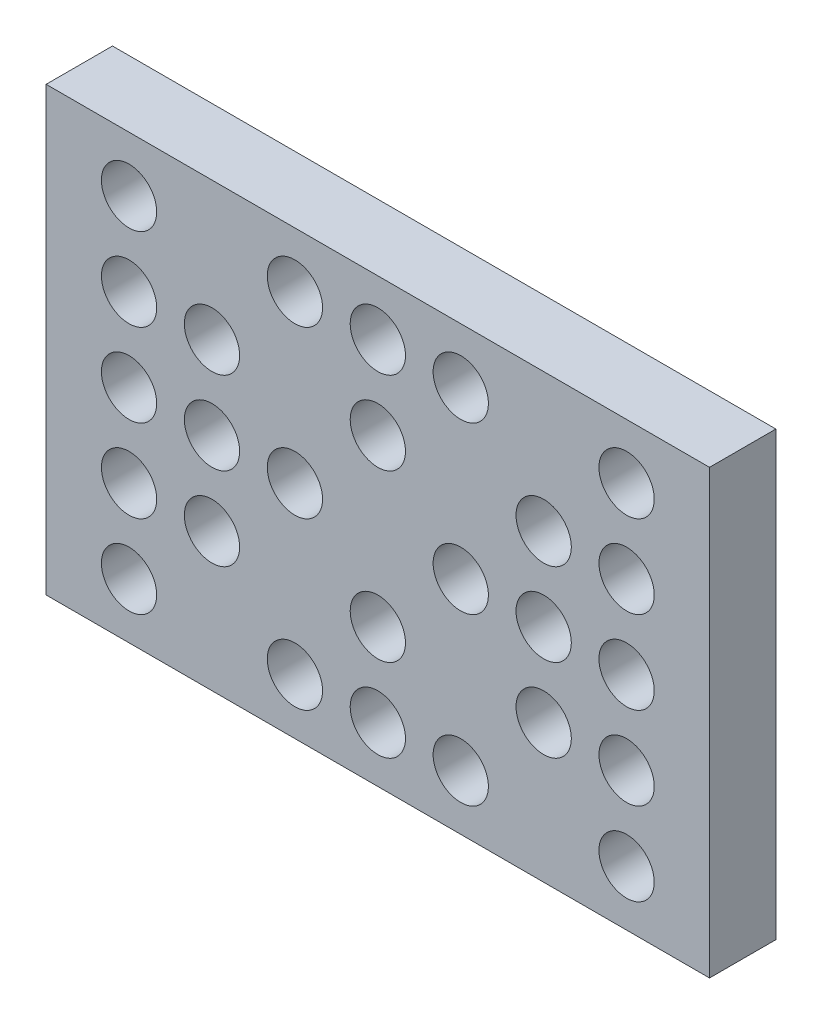
ISO-10303-21;
HEADER;
FILE_DESCRIPTION(('STEP AP214'),'2;1');
FILE_NAME('part.step','',(''),(''),'','','');
FILE_SCHEMA(('AUTOMOTIVE_DESIGN { 1 0 10303 214 1 1 1 1 }'));
ENDSEC;
DATA;
#1=APPLICATION_CONTEXT('core data for automotive mechanical design processes');
#2=APPLICATION_PROTOCOL_DEFINITION('international standard','automotive_design',2000,#1);
#3=PRODUCT_CONTEXT('',#1,'mechanical');
#4=PRODUCT('Part','Part','',(#3));
#5=PRODUCT_RELATED_PRODUCT_CATEGORY('part','',(#4));
#6=PRODUCT_DEFINITION_FORMATION('','',#4);
#7=PRODUCT_DEFINITION_CONTEXT('part definition',#1,'design');
#8=PRODUCT_DEFINITION('design','',#6,#7);
#9=PRODUCT_DEFINITION_SHAPE('','',#8);
#10=(LENGTH_UNIT() NAMED_UNIT(*) SI_UNIT(.MILLI.,.METRE.));
#11=(NAMED_UNIT(*) PLANE_ANGLE_UNIT() SI_UNIT($,.RADIAN.));
#12=(NAMED_UNIT(*) SI_UNIT($,.STERADIAN.) SOLID_ANGLE_UNIT());
#13=UNCERTAINTY_MEASURE_WITH_UNIT(LENGTH_MEASURE(1.E-05),#10,'distance_accuracy_value','');
#14=(GEOMETRIC_REPRESENTATION_CONTEXT(3) GLOBAL_UNCERTAINTY_ASSIGNED_CONTEXT((#13)) GLOBAL_UNIT_ASSIGNED_CONTEXT((#10,
#11,#12)) REPRESENTATION_CONTEXT('',''));
#15=CARTESIAN_POINT('',(0.,0.,0.));
#16=DIRECTION('',(0.,0.,1.));
#17=DIRECTION('',(1.,0.,0.));
#18=AXIS2_PLACEMENT_3D('',#15,#16,#17);
#19=CARTESIAN_POINT('',(-45.,30.,12.001));
#20=DIRECTION('',(0.,0.,-1.));
#21=DIRECTION('',(-1.,0.,0.));
#22=AXIS2_PLACEMENT_3D('',#19,#20,#21);
#23=CYLINDRICAL_SURFACE('',#22,5.);
#24=CARTESIAN_POINT('',(-45.,30.,12.));
#25=DIRECTION('',(0.,0.,1.));
#26=DIRECTION('',(1.,0.,0.));
#27=AXIS2_PLACEMENT_3D('',#24,#25,#26);
#28=CIRCLE('',#27,5.);
#29=CARTESIAN_POINT('',(-40.,30.,12.));
#30=VERTEX_POINT('',#29);
#31=EDGE_CURVE('E43',#30,#30,#28,.F.);
#32=ORIENTED_EDGE('',*,*,#31,.F.);
#33=EDGE_LOOP('',(#32));
#34=FACE_BOUND('',#33,.T.);
#35=CARTESIAN_POINT('',(-45.,30.,0.));
#36=DIRECTION('',(0.,0.,-1.));
#37=DIRECTION('',(-1.,0.,0.));
#38=AXIS2_PLACEMENT_3D('',#35,#36,#37);
#39=CIRCLE('',#38,5.);
#40=CARTESIAN_POINT('',(-50.,30.,0.));
#41=VERTEX_POINT('',#40);
#42=EDGE_CURVE('E11',#41,#41,#39,.T.);
#43=ORIENTED_EDGE('',*,*,#42,.T.);
#44=EDGE_LOOP('',(#43));
#45=FACE_BOUND('',#44,.T.);
#46=ADVANCED_FACE('F35',(#34,#45),#23,.F.);
#47=CARTESIAN_POINT('',(-15.,30.,12.001));
#48=DIRECTION('',(0.,0.,-1.));
#49=DIRECTION('',(-1.,0.,0.));
#50=AXIS2_PLACEMENT_3D('',#47,#48,#49);
#51=CYLINDRICAL_SURFACE('',#50,5.);
#52=CARTESIAN_POINT('',(-15.,30.,12.));
#53=DIRECTION('',(0.,0.,1.));
#54=DIRECTION('',(1.,0.,0.));
#55=AXIS2_PLACEMENT_3D('',#52,#53,#54);
#56=CIRCLE('',#55,5.);
#57=CARTESIAN_POINT('',(-9.99999999999999,30.,12.));
#58=VERTEX_POINT('',#57);
#59=EDGE_CURVE('E245',#58,#58,#56,.F.);
#60=ORIENTED_EDGE('',*,*,#59,.F.);
#61=EDGE_LOOP('',(#60));
#62=FACE_BOUND('',#61,.T.);
#63=CARTESIAN_POINT('',(-15.,30.,0.));
#64=DIRECTION('',(0.,0.,-1.));
#65=DIRECTION('',(-1.,0.,0.));
#66=AXIS2_PLACEMENT_3D('',#63,#64,#65);
#67=CIRCLE('',#66,5.);
#68=CARTESIAN_POINT('',(-20.,30.,0.));
#69=VERTEX_POINT('',#68);
#70=EDGE_CURVE('E248',#69,#69,#67,.T.);
#71=ORIENTED_EDGE('',*,*,#70,.T.);
#72=EDGE_LOOP('',(#71));
#73=FACE_BOUND('',#72,.T.);
#74=ADVANCED_FACE('F256',(#62,#73),#51,.F.);
#75=CARTESIAN_POINT('',(0.,30.,12.001));
#76=DIRECTION('',(0.,0.,-1.));
#77=DIRECTION('',(-1.,0.,0.));
#78=AXIS2_PLACEMENT_3D('',#75,#76,#77);
#79=CYLINDRICAL_SURFACE('',#78,5.);
#80=CARTESIAN_POINT('',(0.,30.,12.));
#81=DIRECTION('',(0.,0.,1.));
#82=DIRECTION('',(1.,0.,0.));
#83=AXIS2_PLACEMENT_3D('',#80,#81,#82);
#84=CIRCLE('',#83,5.);
#85=CARTESIAN_POINT('',(5.,30.,12.));
#86=VERTEX_POINT('',#85);
#87=EDGE_CURVE('E239',#86,#86,#84,.F.);
#88=ORIENTED_EDGE('',*,*,#87,.F.);
#89=EDGE_LOOP('',(#88));
#90=FACE_BOUND('',#89,.T.);
#91=CARTESIAN_POINT('',(0.,30.,0.));
#92=DIRECTION('',(0.,0.,-1.));
#93=DIRECTION('',(-1.,0.,0.));
#94=AXIS2_PLACEMENT_3D('',#91,#92,#93);
#95=CIRCLE('',#94,5.);
#96=CARTESIAN_POINT('',(-4.99999999999999,30.,0.));
#97=VERTEX_POINT('',#96);
#98=EDGE_CURVE('E242',#97,#97,#95,.T.);
#99=ORIENTED_EDGE('',*,*,#98,.T.);
#100=EDGE_LOOP('',(#99));
#101=FACE_BOUND('',#100,.T.);
#102=ADVANCED_FACE('F370',(#90,#101),#79,.F.);
#103=CARTESIAN_POINT('',(15.,30.,12.001));
#104=DIRECTION('',(0.,0.,-1.));
#105=DIRECTION('',(-1.,0.,0.));
#106=AXIS2_PLACEMENT_3D('',#103,#104,#105);
#107=CYLINDRICAL_SURFACE('',#106,5.);
#108=CARTESIAN_POINT('',(15.,30.,12.));
#109=DIRECTION('',(0.,0.,1.));
#110=DIRECTION('',(1.,0.,0.));
#111=AXIS2_PLACEMENT_3D('',#108,#109,#110);
#112=CIRCLE('',#111,5.);
#113=CARTESIAN_POINT('',(20.,30.,12.));
#114=VERTEX_POINT('',#113);
#115=EDGE_CURVE('E233',#114,#114,#112,.F.);
#116=ORIENTED_EDGE('',*,*,#115,.F.);
#117=EDGE_LOOP('',(#116));
#118=FACE_BOUND('',#117,.T.);
#119=CARTESIAN_POINT('',(15.,30.,0.));
#120=DIRECTION('',(0.,0.,-1.));
#121=DIRECTION('',(-1.,0.,0.));
#122=AXIS2_PLACEMENT_3D('',#119,#120,#121);
#123=CIRCLE('',#122,5.);
#124=CARTESIAN_POINT('',(10.,30.,0.));
#125=VERTEX_POINT('',#124);
#126=EDGE_CURVE('E236',#125,#125,#123,.T.);
#127=ORIENTED_EDGE('',*,*,#126,.T.);
#128=EDGE_LOOP('',(#127));
#129=FACE_BOUND('',#128,.T.);
#130=ADVANCED_FACE('F366',(#118,#129),#107,.F.);
#131=CARTESIAN_POINT('',(45.,30.,12.001));
#132=DIRECTION('',(0.,0.,-1.));
#133=DIRECTION('',(-1.,0.,0.));
#134=AXIS2_PLACEMENT_3D('',#131,#132,#133);
#135=CYLINDRICAL_SURFACE('',#134,5.);
#136=CARTESIAN_POINT('',(45.,30.,12.));
#137=DIRECTION('',(0.,0.,1.));
#138=DIRECTION('',(1.,0.,0.));
#139=AXIS2_PLACEMENT_3D('',#136,#137,#138);
#140=CIRCLE('',#139,5.);
#141=CARTESIAN_POINT('',(50.,30.,12.));
#142=VERTEX_POINT('',#141);
#143=EDGE_CURVE('E227',#142,#142,#140,.F.);
#144=ORIENTED_EDGE('',*,*,#143,.F.);
#145=EDGE_LOOP('',(#144));
#146=FACE_BOUND('',#145,.T.);
#147=CARTESIAN_POINT('',(45.,30.,0.));
#148=DIRECTION('',(0.,0.,-1.));
#149=DIRECTION('',(-1.,0.,0.));
#150=AXIS2_PLACEMENT_3D('',#147,#148,#149);
#151=CIRCLE('',#150,5.);
#152=CARTESIAN_POINT('',(40.,30.,0.));
#153=VERTEX_POINT('',#152);
#154=EDGE_CURVE('E230',#153,#153,#151,.T.);
#155=ORIENTED_EDGE('',*,*,#154,.T.);
#156=EDGE_LOOP('',(#155));
#157=FACE_BOUND('',#156,.T.);
#158=ADVANCED_FACE('F362',(#146,#157),#135,.F.);
#159=CARTESIAN_POINT('',(-45.,15.,12.001));
#160=DIRECTION('',(0.,0.,-1.));
#161=DIRECTION('',(-1.,0.,0.));
#162=AXIS2_PLACEMENT_3D('',#159,#160,#161);
#163=CYLINDRICAL_SURFACE('',#162,5.);
#164=CARTESIAN_POINT('',(-45.,15.,12.));
#165=DIRECTION('',(0.,0.,1.));
#166=DIRECTION('',(1.,0.,0.));
#167=AXIS2_PLACEMENT_3D('',#164,#165,#166);
#168=CIRCLE('',#167,5.);
#169=CARTESIAN_POINT('',(-40.,15.,12.));
#170=VERTEX_POINT('',#169);
#171=EDGE_CURVE('E221',#170,#170,#168,.F.);
#172=ORIENTED_EDGE('',*,*,#171,.F.);
#173=EDGE_LOOP('',(#172));
#174=FACE_BOUND('',#173,.T.);
#175=CARTESIAN_POINT('',(-45.,15.,0.));
#176=DIRECTION('',(0.,0.,-1.));
#177=DIRECTION('',(-1.,0.,0.));
#178=AXIS2_PLACEMENT_3D('',#175,#176,#177);
#179=CIRCLE('',#178,5.);
#180=CARTESIAN_POINT('',(-50.,15.,0.));
#181=VERTEX_POINT('',#180);
#182=EDGE_CURVE('E224',#181,#181,#179,.T.);
#183=ORIENTED_EDGE('',*,*,#182,.T.);
#184=EDGE_LOOP('',(#183));
#185=FACE_BOUND('',#184,.T.);
#186=ADVANCED_FACE('F358',(#174,#185),#163,.F.);
#187=CARTESIAN_POINT('',(-30.,15.,12.001));
#188=DIRECTION('',(0.,0.,-1.));
#189=DIRECTION('',(-1.,0.,0.));
#190=AXIS2_PLACEMENT_3D('',#187,#188,#189);
#191=CYLINDRICAL_SURFACE('',#190,5.);
#192=CARTESIAN_POINT('',(-30.,15.,12.));
#193=DIRECTION('',(0.,0.,1.));
#194=DIRECTION('',(1.,0.,0.));
#195=AXIS2_PLACEMENT_3D('',#192,#193,#194);
#196=CIRCLE('',#195,5.);
#197=CARTESIAN_POINT('',(-25.,15.,12.));
#198=VERTEX_POINT('',#197);
#199=EDGE_CURVE('E215',#198,#198,#196,.F.);
#200=ORIENTED_EDGE('',*,*,#199,.F.);
#201=EDGE_LOOP('',(#200));
#202=FACE_BOUND('',#201,.T.);
#203=CARTESIAN_POINT('',(-30.,15.,0.));
#204=DIRECTION('',(0.,0.,-1.));
#205=DIRECTION('',(-1.,0.,0.));
#206=AXIS2_PLACEMENT_3D('',#203,#204,#205);
#207=CIRCLE('',#206,5.);
#208=CARTESIAN_POINT('',(-35.,15.,0.));
#209=VERTEX_POINT('',#208);
#210=EDGE_CURVE('E218',#209,#209,#207,.T.);
#211=ORIENTED_EDGE('',*,*,#210,.T.);
#212=EDGE_LOOP('',(#211));
#213=FACE_BOUND('',#212,.T.);
#214=ADVANCED_FACE('F354',(#202,#213),#191,.F.);
#215=CARTESIAN_POINT('',(0.,15.,12.001));
#216=DIRECTION('',(0.,0.,-1.));
#217=DIRECTION('',(-1.,0.,0.));
#218=AXIS2_PLACEMENT_3D('',#215,#216,#217);
#219=CYLINDRICAL_SURFACE('',#218,5.);
#220=CARTESIAN_POINT('',(0.,15.,12.));
#221=DIRECTION('',(0.,0.,1.));
#222=DIRECTION('',(1.,0.,0.));
#223=AXIS2_PLACEMENT_3D('',#220,#221,#222);
#224=CIRCLE('',#223,5.);
#225=CARTESIAN_POINT('',(5.,15.,12.));
#226=VERTEX_POINT('',#225);
#227=EDGE_CURVE('E209',#226,#226,#224,.F.);
#228=ORIENTED_EDGE('',*,*,#227,.F.);
#229=EDGE_LOOP('',(#228));
#230=FACE_BOUND('',#229,.T.);
#231=CARTESIAN_POINT('',(0.,15.,0.));
#232=DIRECTION('',(0.,0.,-1.));
#233=DIRECTION('',(-1.,0.,0.));
#234=AXIS2_PLACEMENT_3D('',#231,#232,#233);
#235=CIRCLE('',#234,5.);
#236=CARTESIAN_POINT('',(-4.99999999999999,15.,0.));
#237=VERTEX_POINT('',#236);
#238=EDGE_CURVE('E212',#237,#237,#235,.T.);
#239=ORIENTED_EDGE('',*,*,#238,.T.);
#240=EDGE_LOOP('',(#239));
#241=FACE_BOUND('',#240,.T.);
#242=ADVANCED_FACE('F350',(#230,#241),#219,.F.);
#243=CARTESIAN_POINT('',(30.,15.,12.001));
#244=DIRECTION('',(0.,0.,-1.));
#245=DIRECTION('',(-1.,0.,0.));
#246=AXIS2_PLACEMENT_3D('',#243,#244,#245);
#247=CYLINDRICAL_SURFACE('',#246,5.);
#248=CARTESIAN_POINT('',(30.,15.,12.));
#249=DIRECTION('',(0.,0.,1.));
#250=DIRECTION('',(1.,0.,0.));
#251=AXIS2_PLACEMENT_3D('',#248,#249,#250);
#252=CIRCLE('',#251,5.);
#253=CARTESIAN_POINT('',(35.,15.,12.));
#254=VERTEX_POINT('',#253);
#255=EDGE_CURVE('E203',#254,#254,#252,.F.);
#256=ORIENTED_EDGE('',*,*,#255,.F.);
#257=EDGE_LOOP('',(#256));
#258=FACE_BOUND('',#257,.T.);
#259=CARTESIAN_POINT('',(30.,15.,0.));
#260=DIRECTION('',(0.,0.,-1.));
#261=DIRECTION('',(-1.,0.,0.));
#262=AXIS2_PLACEMENT_3D('',#259,#260,#261);
#263=CIRCLE('',#262,5.);
#264=CARTESIAN_POINT('',(25.,15.,0.));
#265=VERTEX_POINT('',#264);
#266=EDGE_CURVE('E206',#265,#265,#263,.T.);
#267=ORIENTED_EDGE('',*,*,#266,.T.);
#268=EDGE_LOOP('',(#267));
#269=FACE_BOUND('',#268,.T.);
#270=ADVANCED_FACE('F346',(#258,#269),#247,.F.);
#271=CARTESIAN_POINT('',(45.,15.,12.001));
#272=DIRECTION('',(0.,0.,-1.));
#273=DIRECTION('',(-1.,0.,0.));
#274=AXIS2_PLACEMENT_3D('',#271,#272,#273);
#275=CYLINDRICAL_SURFACE('',#274,5.);
#276=CARTESIAN_POINT('',(45.,15.,12.));
#277=DIRECTION('',(0.,0.,1.));
#278=DIRECTION('',(1.,0.,0.));
#279=AXIS2_PLACEMENT_3D('',#276,#277,#278);
#280=CIRCLE('',#279,5.);
#281=CARTESIAN_POINT('',(50.,15.,12.));
#282=VERTEX_POINT('',#281);
#283=EDGE_CURVE('E197',#282,#282,#280,.F.);
#284=ORIENTED_EDGE('',*,*,#283,.F.);
#285=EDGE_LOOP('',(#284));
#286=FACE_BOUND('',#285,.T.);
#287=CARTESIAN_POINT('',(45.,15.,0.));
#288=DIRECTION('',(0.,0.,-1.));
#289=DIRECTION('',(-1.,0.,0.));
#290=AXIS2_PLACEMENT_3D('',#287,#288,#289);
#291=CIRCLE('',#290,5.);
#292=CARTESIAN_POINT('',(40.,15.,0.));
#293=VERTEX_POINT('',#292);
#294=EDGE_CURVE('E200',#293,#293,#291,.T.);
#295=ORIENTED_EDGE('',*,*,#294,.T.);
#296=EDGE_LOOP('',(#295));
#297=FACE_BOUND('',#296,.T.);
#298=ADVANCED_FACE('F342',(#286,#297),#275,.F.);
#299=CARTESIAN_POINT('',(-45.,0.,12.001));
#300=DIRECTION('',(0.,0.,-1.));
#301=DIRECTION('',(-1.,0.,0.));
#302=AXIS2_PLACEMENT_3D('',#299,#300,#301);
#303=CYLINDRICAL_SURFACE('',#302,5.);
#304=CARTESIAN_POINT('',(-45.,0.,12.));
#305=DIRECTION('',(0.,0.,1.));
#306=DIRECTION('',(1.,0.,0.));
#307=AXIS2_PLACEMENT_3D('',#304,#305,#306);
#308=CIRCLE('',#307,5.);
#309=CARTESIAN_POINT('',(-40.,0.,12.));
#310=VERTEX_POINT('',#309);
#311=EDGE_CURVE('E191',#310,#310,#308,.F.);
#312=ORIENTED_EDGE('',*,*,#311,.F.);
#313=EDGE_LOOP('',(#312));
#314=FACE_BOUND('',#313,.T.);
#315=CARTESIAN_POINT('',(-45.,0.,0.));
#316=DIRECTION('',(0.,0.,-1.));
#317=DIRECTION('',(-1.,0.,0.));
#318=AXIS2_PLACEMENT_3D('',#315,#316,#317);
#319=CIRCLE('',#318,5.);
#320=CARTESIAN_POINT('',(-50.,0.,0.));
#321=VERTEX_POINT('',#320);
#322=EDGE_CURVE('E194',#321,#321,#319,.T.);
#323=ORIENTED_EDGE('',*,*,#322,.T.);
#324=EDGE_LOOP('',(#323));
#325=FACE_BOUND('',#324,.T.);
#326=ADVANCED_FACE('F338',(#314,#325),#303,.F.);
#327=CARTESIAN_POINT('',(-30.,0.,12.001));
#328=DIRECTION('',(0.,0.,-1.));
#329=DIRECTION('',(-1.,0.,0.));
#330=AXIS2_PLACEMENT_3D('',#327,#328,#329);
#331=CYLINDRICAL_SURFACE('',#330,5.);
#332=CARTESIAN_POINT('',(-30.,0.,12.));
#333=DIRECTION('',(0.,0.,1.));
#334=DIRECTION('',(1.,0.,0.));
#335=AXIS2_PLACEMENT_3D('',#332,#333,#334);
#336=CIRCLE('',#335,5.);
#337=CARTESIAN_POINT('',(-25.,0.,12.));
#338=VERTEX_POINT('',#337);
#339=EDGE_CURVE('E185',#338,#338,#336,.F.);
#340=ORIENTED_EDGE('',*,*,#339,.F.);
#341=EDGE_LOOP('',(#340));
#342=FACE_BOUND('',#341,.T.);
#343=CARTESIAN_POINT('',(-30.,0.,0.));
#344=DIRECTION('',(0.,0.,-1.));
#345=DIRECTION('',(-1.,0.,0.));
#346=AXIS2_PLACEMENT_3D('',#343,#344,#345);
#347=CIRCLE('',#346,5.);
#348=CARTESIAN_POINT('',(-35.,0.,0.));
#349=VERTEX_POINT('',#348);
#350=EDGE_CURVE('E188',#349,#349,#347,.T.);
#351=ORIENTED_EDGE('',*,*,#350,.T.);
#352=EDGE_LOOP('',(#351));
#353=FACE_BOUND('',#352,.T.);
#354=ADVANCED_FACE('F334',(#342,#353),#331,.F.);
#355=CARTESIAN_POINT('',(-15.,0.,12.001));
#356=DIRECTION('',(0.,0.,-1.));
#357=DIRECTION('',(-1.,0.,0.));
#358=AXIS2_PLACEMENT_3D('',#355,#356,#357);
#359=CYLINDRICAL_SURFACE('',#358,5.);
#360=CARTESIAN_POINT('',(-15.,0.,12.));
#361=DIRECTION('',(0.,0.,1.));
#362=DIRECTION('',(1.,0.,0.));
#363=AXIS2_PLACEMENT_3D('',#360,#361,#362);
#364=CIRCLE('',#363,5.);
#365=CARTESIAN_POINT('',(-9.99999999999999,0.,12.));
#366=VERTEX_POINT('',#365);
#367=EDGE_CURVE('E179',#366,#366,#364,.F.);
#368=ORIENTED_EDGE('',*,*,#367,.F.);
#369=EDGE_LOOP('',(#368));
#370=FACE_BOUND('',#369,.T.);
#371=CARTESIAN_POINT('',(-15.,0.,0.));
#372=DIRECTION('',(0.,0.,-1.));
#373=DIRECTION('',(-1.,0.,0.));
#374=AXIS2_PLACEMENT_3D('',#371,#372,#373);
#375=CIRCLE('',#374,5.);
#376=CARTESIAN_POINT('',(-20.,0.,0.));
#377=VERTEX_POINT('',#376);
#378=EDGE_CURVE('E182',#377,#377,#375,.T.);
#379=ORIENTED_EDGE('',*,*,#378,.T.);
#380=EDGE_LOOP('',(#379));
#381=FACE_BOUND('',#380,.T.);
#382=ADVANCED_FACE('F330',(#370,#381),#359,.F.);
#383=CARTESIAN_POINT('',(15.,0.,12.001));
#384=DIRECTION('',(0.,0.,-1.));
#385=DIRECTION('',(-1.,0.,0.));
#386=AXIS2_PLACEMENT_3D('',#383,#384,#385);
#387=CYLINDRICAL_SURFACE('',#386,5.);
#388=CARTESIAN_POINT('',(15.,0.,12.));
#389=DIRECTION('',(0.,0.,1.));
#390=DIRECTION('',(1.,0.,0.));
#391=AXIS2_PLACEMENT_3D('',#388,#389,#390);
#392=CIRCLE('',#391,5.);
#393=CARTESIAN_POINT('',(20.,0.,12.));
#394=VERTEX_POINT('',#393);
#395=EDGE_CURVE('E173',#394,#394,#392,.F.);
#396=ORIENTED_EDGE('',*,*,#395,.F.);
#397=EDGE_LOOP('',(#396));
#398=FACE_BOUND('',#397,.T.);
#399=CARTESIAN_POINT('',(15.,0.,0.));
#400=DIRECTION('',(0.,0.,-1.));
#401=DIRECTION('',(-1.,0.,0.));
#402=AXIS2_PLACEMENT_3D('',#399,#400,#401);
#403=CIRCLE('',#402,5.);
#404=CARTESIAN_POINT('',(10.,0.,0.));
#405=VERTEX_POINT('',#404);
#406=EDGE_CURVE('E176',#405,#405,#403,.T.);
#407=ORIENTED_EDGE('',*,*,#406,.T.);
#408=EDGE_LOOP('',(#407));
#409=FACE_BOUND('',#408,.T.);
#410=ADVANCED_FACE('F326',(#398,#409),#387,.F.);
#411=CARTESIAN_POINT('',(30.,0.,12.001));
#412=DIRECTION('',(0.,0.,-1.));
#413=DIRECTION('',(-1.,0.,0.));
#414=AXIS2_PLACEMENT_3D('',#411,#412,#413);
#415=CYLINDRICAL_SURFACE('',#414,5.);
#416=CARTESIAN_POINT('',(30.,0.,12.));
#417=DIRECTION('',(0.,0.,1.));
#418=DIRECTION('',(1.,0.,0.));
#419=AXIS2_PLACEMENT_3D('',#416,#417,#418);
#420=CIRCLE('',#419,5.);
#421=CARTESIAN_POINT('',(35.,0.,12.));
#422=VERTEX_POINT('',#421);
#423=EDGE_CURVE('E167',#422,#422,#420,.F.);
#424=ORIENTED_EDGE('',*,*,#423,.F.);
#425=EDGE_LOOP('',(#424));
#426=FACE_BOUND('',#425,.T.);
#427=CARTESIAN_POINT('',(30.,0.,0.));
#428=DIRECTION('',(0.,0.,-1.));
#429=DIRECTION('',(-1.,0.,0.));
#430=AXIS2_PLACEMENT_3D('',#427,#428,#429);
#431=CIRCLE('',#430,5.);
#432=CARTESIAN_POINT('',(25.,0.,0.));
#433=VERTEX_POINT('',#432);
#434=EDGE_CURVE('E170',#433,#433,#431,.T.);
#435=ORIENTED_EDGE('',*,*,#434,.T.);
#436=EDGE_LOOP('',(#435));
#437=FACE_BOUND('',#436,.T.);
#438=ADVANCED_FACE('F322',(#426,#437),#415,.F.);
#439=CARTESIAN_POINT('',(45.,0.,12.001));
#440=DIRECTION('',(0.,0.,-1.));
#441=DIRECTION('',(-1.,0.,0.));
#442=AXIS2_PLACEMENT_3D('',#439,#440,#441);
#443=CYLINDRICAL_SURFACE('',#442,5.);
#444=CARTESIAN_POINT('',(45.,0.,12.));
#445=DIRECTION('',(0.,0.,1.));
#446=DIRECTION('',(1.,0.,0.));
#447=AXIS2_PLACEMENT_3D('',#444,#445,#446);
#448=CIRCLE('',#447,5.);
#449=CARTESIAN_POINT('',(50.,0.,12.));
#450=VERTEX_POINT('',#449);
#451=EDGE_CURVE('E161',#450,#450,#448,.F.);
#452=ORIENTED_EDGE('',*,*,#451,.F.);
#453=EDGE_LOOP('',(#452));
#454=FACE_BOUND('',#453,.T.);
#455=CARTESIAN_POINT('',(45.,0.,0.));
#456=DIRECTION('',(0.,0.,-1.));
#457=DIRECTION('',(-1.,0.,0.));
#458=AXIS2_PLACEMENT_3D('',#455,#456,#457);
#459=CIRCLE('',#458,5.);
#460=CARTESIAN_POINT('',(40.,0.,0.));
#461=VERTEX_POINT('',#460);
#462=EDGE_CURVE('E164',#461,#461,#459,.T.);
#463=ORIENTED_EDGE('',*,*,#462,.T.);
#464=EDGE_LOOP('',(#463));
#465=FACE_BOUND('',#464,.T.);
#466=ADVANCED_FACE('F318',(#454,#465),#443,.F.);
#467=CARTESIAN_POINT('',(-45.,-15.,12.001));
#468=DIRECTION('',(0.,0.,-1.));
#469=DIRECTION('',(-1.,0.,0.));
#470=AXIS2_PLACEMENT_3D('',#467,#468,#469);
#471=CYLINDRICAL_SURFACE('',#470,5.);
#472=CARTESIAN_POINT('',(-45.,-15.,12.));
#473=DIRECTION('',(0.,0.,1.));
#474=DIRECTION('',(1.,0.,0.));
#475=AXIS2_PLACEMENT_3D('',#472,#473,#474);
#476=CIRCLE('',#475,5.);
#477=CARTESIAN_POINT('',(-40.,-15.,12.));
#478=VERTEX_POINT('',#477);
#479=EDGE_CURVE('E155',#478,#478,#476,.F.);
#480=ORIENTED_EDGE('',*,*,#479,.F.);
#481=EDGE_LOOP('',(#480));
#482=FACE_BOUND('',#481,.T.);
#483=CARTESIAN_POINT('',(-45.,-15.,0.));
#484=DIRECTION('',(0.,0.,-1.));
#485=DIRECTION('',(-1.,0.,0.));
#486=AXIS2_PLACEMENT_3D('',#483,#484,#485);
#487=CIRCLE('',#486,5.);
#488=CARTESIAN_POINT('',(-50.,-15.,0.));
#489=VERTEX_POINT('',#488);
#490=EDGE_CURVE('E158',#489,#489,#487,.T.);
#491=ORIENTED_EDGE('',*,*,#490,.T.);
#492=EDGE_LOOP('',(#491));
#493=FACE_BOUND('',#492,.T.);
#494=ADVANCED_FACE('F314',(#482,#493),#471,.F.);
#495=CARTESIAN_POINT('',(-30.,-15.,12.001));
#496=DIRECTION('',(0.,0.,-1.));
#497=DIRECTION('',(-1.,0.,0.));
#498=AXIS2_PLACEMENT_3D('',#495,#496,#497);
#499=CYLINDRICAL_SURFACE('',#498,5.);
#500=CARTESIAN_POINT('',(-30.,-15.,12.));
#501=DIRECTION('',(0.,0.,1.));
#502=DIRECTION('',(1.,0.,0.));
#503=AXIS2_PLACEMENT_3D('',#500,#501,#502);
#504=CIRCLE('',#503,5.);
#505=CARTESIAN_POINT('',(-25.,-15.,12.));
#506=VERTEX_POINT('',#505);
#507=EDGE_CURVE('E149',#506,#506,#504,.F.);
#508=ORIENTED_EDGE('',*,*,#507,.F.);
#509=EDGE_LOOP('',(#508));
#510=FACE_BOUND('',#509,.T.);
#511=CARTESIAN_POINT('',(-30.,-15.,0.));
#512=DIRECTION('',(0.,0.,-1.));
#513=DIRECTION('',(-1.,0.,0.));
#514=AXIS2_PLACEMENT_3D('',#511,#512,#513);
#515=CIRCLE('',#514,5.);
#516=CARTESIAN_POINT('',(-35.,-15.,0.));
#517=VERTEX_POINT('',#516);
#518=EDGE_CURVE('E152',#517,#517,#515,.T.);
#519=ORIENTED_EDGE('',*,*,#518,.T.);
#520=EDGE_LOOP('',(#519));
#521=FACE_BOUND('',#520,.T.);
#522=ADVANCED_FACE('F310',(#510,#521),#499,.F.);
#523=CARTESIAN_POINT('',(0.,-15.,12.001));
#524=DIRECTION('',(0.,0.,-1.));
#525=DIRECTION('',(-1.,0.,0.));
#526=AXIS2_PLACEMENT_3D('',#523,#524,#525);
#527=CYLINDRICAL_SURFACE('',#526,5.);
#528=CARTESIAN_POINT('',(0.,-15.,12.));
#529=DIRECTION('',(0.,0.,1.));
#530=DIRECTION('',(1.,0.,0.));
#531=AXIS2_PLACEMENT_3D('',#528,#529,#530);
#532=CIRCLE('',#531,5.);
#533=CARTESIAN_POINT('',(5.00000000000001,-15.,12.));
#534=VERTEX_POINT('',#533);
#535=EDGE_CURVE('E143',#534,#534,#532,.F.);
#536=ORIENTED_EDGE('',*,*,#535,.F.);
#537=EDGE_LOOP('',(#536));
#538=FACE_BOUND('',#537,.T.);
#539=CARTESIAN_POINT('',(0.,-15.,0.));
#540=DIRECTION('',(0.,0.,-1.));
#541=DIRECTION('',(-1.,0.,0.));
#542=AXIS2_PLACEMENT_3D('',#539,#540,#541);
#543=CIRCLE('',#542,5.);
#544=CARTESIAN_POINT('',(-4.99999999999998,-15.,0.));
#545=VERTEX_POINT('',#544);
#546=EDGE_CURVE('E146',#545,#545,#543,.T.);
#547=ORIENTED_EDGE('',*,*,#546,.T.);
#548=EDGE_LOOP('',(#547));
#549=FACE_BOUND('',#548,.T.);
#550=ADVANCED_FACE('F306',(#538,#549),#527,.F.);
#551=CARTESIAN_POINT('',(30.,-15.,12.001));
#552=DIRECTION('',(0.,0.,-1.));
#553=DIRECTION('',(-1.,0.,0.));
#554=AXIS2_PLACEMENT_3D('',#551,#552,#553);
#555=CYLINDRICAL_SURFACE('',#554,5.);
#556=CARTESIAN_POINT('',(30.,-15.,12.));
#557=DIRECTION('',(0.,0.,1.));
#558=DIRECTION('',(1.,0.,0.));
#559=AXIS2_PLACEMENT_3D('',#556,#557,#558);
#560=CIRCLE('',#559,5.);
#561=CARTESIAN_POINT('',(35.,-15.,12.));
#562=VERTEX_POINT('',#561);
#563=EDGE_CURVE('E137',#562,#562,#560,.F.);
#564=ORIENTED_EDGE('',*,*,#563,.F.);
#565=EDGE_LOOP('',(#564));
#566=FACE_BOUND('',#565,.T.);
#567=CARTESIAN_POINT('',(30.,-15.,0.));
#568=DIRECTION('',(0.,0.,-1.));
#569=DIRECTION('',(-1.,0.,0.));
#570=AXIS2_PLACEMENT_3D('',#567,#568,#569);
#571=CIRCLE('',#570,5.);
#572=CARTESIAN_POINT('',(25.,-15.,0.));
#573=VERTEX_POINT('',#572);
#574=EDGE_CURVE('E140',#573,#573,#571,.T.);
#575=ORIENTED_EDGE('',*,*,#574,.T.);
#576=EDGE_LOOP('',(#575));
#577=FACE_BOUND('',#576,.T.);
#578=ADVANCED_FACE('F302',(#566,#577),#555,.F.);
#579=CARTESIAN_POINT('',(45.,-15.,12.001));
#580=DIRECTION('',(0.,0.,-1.));
#581=DIRECTION('',(-1.,0.,0.));
#582=AXIS2_PLACEMENT_3D('',#579,#580,#581);
#583=CYLINDRICAL_SURFACE('',#582,5.);
#584=CARTESIAN_POINT('',(45.,-15.,12.));
#585=DIRECTION('',(0.,0.,1.));
#586=DIRECTION('',(1.,0.,0.));
#587=AXIS2_PLACEMENT_3D('',#584,#585,#586);
#588=CIRCLE('',#587,5.);
#589=CARTESIAN_POINT('',(50.,-15.,12.));
#590=VERTEX_POINT('',#589);
#591=EDGE_CURVE('E131',#590,#590,#588,.F.);
#592=ORIENTED_EDGE('',*,*,#591,.F.);
#593=EDGE_LOOP('',(#592));
#594=FACE_BOUND('',#593,.T.);
#595=CARTESIAN_POINT('',(45.,-15.,0.));
#596=DIRECTION('',(0.,0.,-1.));
#597=DIRECTION('',(-1.,0.,0.));
#598=AXIS2_PLACEMENT_3D('',#595,#596,#597);
#599=CIRCLE('',#598,5.);
#600=CARTESIAN_POINT('',(40.,-15.,0.));
#601=VERTEX_POINT('',#600);
#602=EDGE_CURVE('E134',#601,#601,#599,.T.);
#603=ORIENTED_EDGE('',*,*,#602,.T.);
#604=EDGE_LOOP('',(#603));
#605=FACE_BOUND('',#604,.T.);
#606=ADVANCED_FACE('F298',(#594,#605),#583,.F.);
#607=CARTESIAN_POINT('',(-45.,-30.,12.001));
#608=DIRECTION('',(0.,0.,-1.));
#609=DIRECTION('',(-1.,0.,0.));
#610=AXIS2_PLACEMENT_3D('',#607,#608,#609);
#611=CYLINDRICAL_SURFACE('',#610,5.);
#612=CARTESIAN_POINT('',(-45.,-30.,12.));
#613=DIRECTION('',(0.,0.,1.));
#614=DIRECTION('',(1.,0.,0.));
#615=AXIS2_PLACEMENT_3D('',#612,#613,#614);
#616=CIRCLE('',#615,5.);
#617=CARTESIAN_POINT('',(-40.,-30.,12.));
#618=VERTEX_POINT('',#617);
#619=EDGE_CURVE('E125',#618,#618,#616,.F.);
#620=ORIENTED_EDGE('',*,*,#619,.F.);
#621=EDGE_LOOP('',(#620));
#622=FACE_BOUND('',#621,.T.);
#623=CARTESIAN_POINT('',(-45.,-30.,0.));
#624=DIRECTION('',(0.,0.,-1.));
#625=DIRECTION('',(-1.,0.,0.));
#626=AXIS2_PLACEMENT_3D('',#623,#624,#625);
#627=CIRCLE('',#626,5.);
#628=CARTESIAN_POINT('',(-50.,-30.,0.));
#629=VERTEX_POINT('',#628);
#630=EDGE_CURVE('E128',#629,#629,#627,.T.);
#631=ORIENTED_EDGE('',*,*,#630,.T.);
#632=EDGE_LOOP('',(#631));
#633=FACE_BOUND('',#632,.T.);
#634=ADVANCED_FACE('F294',(#622,#633),#611,.F.);
#635=CARTESIAN_POINT('',(-15.,-30.,12.001));
#636=DIRECTION('',(0.,0.,-1.));
#637=DIRECTION('',(-1.,0.,0.));
#638=AXIS2_PLACEMENT_3D('',#635,#636,#637);
#639=CYLINDRICAL_SURFACE('',#638,5.);
#640=CARTESIAN_POINT('',(-15.,-30.,12.));
#641=DIRECTION('',(0.,0.,1.));
#642=DIRECTION('',(1.,0.,0.));
#643=AXIS2_PLACEMENT_3D('',#640,#641,#642);
#644=CIRCLE('',#643,5.);
#645=CARTESIAN_POINT('',(-9.99999999999999,-30.,12.));
#646=VERTEX_POINT('',#645);
#647=EDGE_CURVE('E119',#646,#646,#644,.F.);
#648=ORIENTED_EDGE('',*,*,#647,.F.);
#649=EDGE_LOOP('',(#648));
#650=FACE_BOUND('',#649,.T.);
#651=CARTESIAN_POINT('',(-15.,-30.,0.));
#652=DIRECTION('',(0.,0.,-1.));
#653=DIRECTION('',(-1.,0.,0.));
#654=AXIS2_PLACEMENT_3D('',#651,#652,#653);
#655=CIRCLE('',#654,5.);
#656=CARTESIAN_POINT('',(-20.,-30.,0.));
#657=VERTEX_POINT('',#656);
#658=EDGE_CURVE('E122',#657,#657,#655,.T.);
#659=ORIENTED_EDGE('',*,*,#658,.T.);
#660=EDGE_LOOP('',(#659));
#661=FACE_BOUND('',#660,.T.);
#662=ADVANCED_FACE('F290',(#650,#661),#639,.F.);
#663=CARTESIAN_POINT('',(0.,-30.,12.001));
#664=DIRECTION('',(0.,0.,-1.));
#665=DIRECTION('',(-1.,0.,0.));
#666=AXIS2_PLACEMENT_3D('',#663,#664,#665);
#667=CYLINDRICAL_SURFACE('',#666,5.);
#668=CARTESIAN_POINT('',(0.,-30.,12.));
#669=DIRECTION('',(0.,0.,1.));
#670=DIRECTION('',(1.,0.,0.));
#671=AXIS2_PLACEMENT_3D('',#668,#669,#670);
#672=CIRCLE('',#671,5.);
#673=CARTESIAN_POINT('',(5.00000000000001,-30.,12.));
#674=VERTEX_POINT('',#673);
#675=EDGE_CURVE('E113',#674,#674,#672,.F.);
#676=ORIENTED_EDGE('',*,*,#675,.F.);
#677=EDGE_LOOP('',(#676));
#678=FACE_BOUND('',#677,.T.);
#679=CARTESIAN_POINT('',(0.,-30.,0.));
#680=DIRECTION('',(0.,0.,-1.));
#681=DIRECTION('',(-1.,0.,0.));
#682=AXIS2_PLACEMENT_3D('',#679,#680,#681);
#683=CIRCLE('',#682,5.);
#684=CARTESIAN_POINT('',(-4.99999999999998,-30.,0.));
#685=VERTEX_POINT('',#684);
#686=EDGE_CURVE('E116',#685,#685,#683,.T.);
#687=ORIENTED_EDGE('',*,*,#686,.T.);
#688=EDGE_LOOP('',(#687));
#689=FACE_BOUND('',#688,.T.);
#690=ADVANCED_FACE('F286',(#678,#689),#667,.F.);
#691=CARTESIAN_POINT('',(60.,40.,12.));
#692=DIRECTION('',(-1.,0.,0.));
#693=DIRECTION('',(0.,-1.,0.));
#694=AXIS2_PLACEMENT_3D('',#691,#692,#693);
#695=PLANE('',#694);
#696=DIRECTION('',(0.,1.,0.));
#697=VECTOR('',#696,1.);
#698=CARTESIAN_POINT('',(60.,40.,0.));
#699=LINE('',#698,#697);
#700=CARTESIAN_POINT('',(60.,-40.,0.));
#701=VERTEX_POINT('',#700);
#702=CARTESIAN_POINT('',(60.,40.,0.));
#703=VERTEX_POINT('',#702);
#704=EDGE_CURVE('E103',#701,#703,#699,.T.);
#705=ORIENTED_EDGE('',*,*,#704,.T.);
#706=DIRECTION('',(0.,0.,-1.));
#707=VECTOR('',#706,1.);
#708=CARTESIAN_POINT('',(60.,40.,12.));
#709=LINE('',#708,#707);
#710=CARTESIAN_POINT('',(60.,40.,12.));
#711=VERTEX_POINT('',#710);
#712=EDGE_CURVE('E94',#711,#703,#709,.T.);
#713=ORIENTED_EDGE('',*,*,#712,.F.);
#714=DIRECTION('',(0.,1.,0.));
#715=VECTOR('',#714,1.);
#716=CARTESIAN_POINT('',(60.,40.,12.));
#717=LINE('',#716,#715);
#718=CARTESIAN_POINT('',(60.,-40.,12.));
#719=VERTEX_POINT('',#718);
#720=EDGE_CURVE('E88',#719,#711,#717,.T.);
#721=ORIENTED_EDGE('',*,*,#720,.F.);
#722=DIRECTION('',(0.,0.,-1.));
#723=VECTOR('',#722,1.);
#724=CARTESIAN_POINT('',(60.,-40.,12.));
#725=LINE('',#724,#723);
#726=EDGE_CURVE('E99',#719,#701,#725,.T.);
#727=ORIENTED_EDGE('',*,*,#726,.T.);
#728=EDGE_LOOP('',(#705,#713,#721,#727));
#729=FACE_BOUND('',#728,.T.);
#730=ADVANCED_FACE('F283',(#729),#695,.F.);
#731=CARTESIAN_POINT('',(-60.,40.,12.));
#732=DIRECTION('',(0.,-1.,0.));
#733=DIRECTION('',(0.,0.,-1.));
#734=AXIS2_PLACEMENT_3D('',#731,#732,#733);
#735=PLANE('',#734);
#736=DIRECTION('',(-1.,0.,0.));
#737=VECTOR('',#736,1.);
#738=CARTESIAN_POINT('',(-60.,40.,0.));
#739=LINE('',#738,#737);
#740=CARTESIAN_POINT('',(-60.,40.,0.));
#741=VERTEX_POINT('',#740);
#742=EDGE_CURVE('E93',#703,#741,#739,.T.);
#743=ORIENTED_EDGE('',*,*,#742,.T.);
#744=DIRECTION('',(0.,0.,-1.));
#745=VECTOR('',#744,1.);
#746=CARTESIAN_POINT('',(-60.,40.,12.));
#747=LINE('',#746,#745);
#748=CARTESIAN_POINT('',(-60.,40.,12.));
#749=VERTEX_POINT('',#748);
#750=EDGE_CURVE('E91',#749,#741,#747,.T.);
#751=ORIENTED_EDGE('',*,*,#750,.F.);
#752=DIRECTION('',(-1.,0.,0.));
#753=VECTOR('',#752,1.);
#754=CARTESIAN_POINT('',(-60.,40.,12.));
#755=LINE('',#754,#753);
#756=EDGE_CURVE('E82',#711,#749,#755,.T.);
#757=ORIENTED_EDGE('',*,*,#756,.F.);
#758=ORIENTED_EDGE('',*,*,#712,.T.);
#759=EDGE_LOOP('',(#743,#751,#757,#758));
#760=FACE_BOUND('',#759,.T.);
#761=ADVANCED_FACE('F92',(#760),#735,.F.);
#762=CARTESIAN_POINT('',(-60.,40.,12.));
#763=DIRECTION('',(1.,0.,0.));
#764=DIRECTION('',(0.,0.,-1.));
#765=AXIS2_PLACEMENT_3D('',#762,#763,#764);
#766=PLANE('',#765);
#767=DIRECTION('',(0.,-1.,0.));
#768=VECTOR('',#767,1.);
#769=CARTESIAN_POINT('',(-60.,40.,0.));
#770=LINE('',#769,#768);
#771=CARTESIAN_POINT('',(-60.,-40.,0.));
#772=VERTEX_POINT('',#771);
#773=EDGE_CURVE('E68',#741,#772,#770,.T.);
#774=ORIENTED_EDGE('',*,*,#773,.T.);
#775=DIRECTION('',(0.,0.,-1.));
#776=VECTOR('',#775,1.);
#777=CARTESIAN_POINT('',(-60.,-40.,12.));
#778=LINE('',#777,#776);
#779=CARTESIAN_POINT('',(-60.,-40.,12.));
#780=VERTEX_POINT('',#779);
#781=EDGE_CURVE('E95',#780,#772,#778,.T.);
#782=ORIENTED_EDGE('',*,*,#781,.F.);
#783=DIRECTION('',(0.,-1.,0.));
#784=VECTOR('',#783,1.);
#785=CARTESIAN_POINT('',(-60.,40.,12.));
#786=LINE('',#785,#784);
#787=EDGE_CURVE('E86',#749,#780,#786,.T.);
#788=ORIENTED_EDGE('',*,*,#787,.F.);
#789=ORIENTED_EDGE('',*,*,#750,.T.);
#790=EDGE_LOOP('',(#774,#782,#788,#789));
#791=FACE_BOUND('',#790,.T.);
#792=ADVANCED_FACE('F97',(#791),#766,.F.);
#793=CARTESIAN_POINT('',(-60.,-40.,12.));
#794=DIRECTION('',(0.,1.,0.));
#795=DIRECTION('',(0.,0.,1.));
#796=AXIS2_PLACEMENT_3D('',#793,#794,#795);
#797=PLANE('',#796);
#798=DIRECTION('',(1.,0.,0.));
#799=VECTOR('',#798,1.);
#800=CARTESIAN_POINT('',(-60.,-40.,0.));
#801=LINE('',#800,#799);
#802=EDGE_CURVE('E74',#772,#701,#801,.T.);
#803=ORIENTED_EDGE('',*,*,#802,.T.);
#804=ORIENTED_EDGE('',*,*,#726,.F.);
#805=DIRECTION('',(1.,0.,0.));
#806=VECTOR('',#805,1.);
#807=CARTESIAN_POINT('',(-60.,-40.,12.));
#808=LINE('',#807,#806);
#809=EDGE_CURVE('E51',#780,#719,#808,.T.);
#810=ORIENTED_EDGE('',*,*,#809,.F.);
#811=ORIENTED_EDGE('',*,*,#781,.T.);
#812=EDGE_LOOP('',(#803,#804,#810,#811));
#813=FACE_BOUND('',#812,.T.);
#814=ADVANCED_FACE('F271',(#813),#797,.F.);
#815=CARTESIAN_POINT('',(0.,0.,12.));
#816=DIRECTION('',(0.,0.,1.));
#817=DIRECTION('',(1.,0.,0.));
#818=AXIS2_PLACEMENT_3D('',#815,#816,#817);
#819=PLANE('',#818);
#820=CARTESIAN_POINT('',(15.,-30.,12.));
#821=DIRECTION('',(0.,0.,1.));
#822=DIRECTION('',(1.,0.,0.));
#823=AXIS2_PLACEMENT_3D('',#820,#821,#822);
#824=CIRCLE('',#823,5.);
#825=CARTESIAN_POINT('',(20.,-30.,12.));
#826=VERTEX_POINT('',#825);
#827=EDGE_CURVE('E569',#826,#826,#824,.F.);
#828=ORIENTED_EDGE('',*,*,#827,.T.);
#829=EDGE_LOOP('',(#828));
#830=FACE_BOUND('',#829,.T.);
#831=CARTESIAN_POINT('',(45.,-30.,12.));
#832=DIRECTION('',(0.,0.,1.));
#833=DIRECTION('',(1.,0.,0.));
#834=AXIS2_PLACEMENT_3D('',#831,#832,#833);
#835=CIRCLE('',#834,5.);
#836=CARTESIAN_POINT('',(50.,-30.,12.));
#837=VERTEX_POINT('',#836);
#838=EDGE_CURVE('E572',#837,#837,#835,.F.);
#839=ORIENTED_EDGE('',*,*,#838,.T.);
#840=EDGE_LOOP('',(#839));
#841=FACE_BOUND('',#840,.T.);
#842=ORIENTED_EDGE('',*,*,#720,.T.);
#843=ORIENTED_EDGE('',*,*,#756,.T.);
#844=ORIENTED_EDGE('',*,*,#787,.T.);
#845=ORIENTED_EDGE('',*,*,#809,.T.);
#846=EDGE_LOOP('',(#842,#843,#844,#845));
#847=FACE_BOUND('',#846,.T.);
#848=ORIENTED_EDGE('',*,*,#675,.T.);
#849=EDGE_LOOP('',(#848));
#850=FACE_BOUND('',#849,.T.);
#851=ORIENTED_EDGE('',*,*,#647,.T.);
#852=EDGE_LOOP('',(#851));
#853=FACE_BOUND('',#852,.T.);
#854=ORIENTED_EDGE('',*,*,#619,.T.);
#855=EDGE_LOOP('',(#854));
#856=FACE_BOUND('',#855,.T.);
#857=ORIENTED_EDGE('',*,*,#591,.T.);
#858=EDGE_LOOP('',(#857));
#859=FACE_BOUND('',#858,.T.);
#860=ORIENTED_EDGE('',*,*,#563,.T.);
#861=EDGE_LOOP('',(#860));
#862=FACE_BOUND('',#861,.T.);
#863=ORIENTED_EDGE('',*,*,#535,.T.);
#864=EDGE_LOOP('',(#863));
#865=FACE_BOUND('',#864,.T.);
#866=ORIENTED_EDGE('',*,*,#507,.T.);
#867=EDGE_LOOP('',(#866));
#868=FACE_BOUND('',#867,.T.);
#869=ORIENTED_EDGE('',*,*,#479,.T.);
#870=EDGE_LOOP('',(#869));
#871=FACE_BOUND('',#870,.T.);
#872=ORIENTED_EDGE('',*,*,#451,.T.);
#873=EDGE_LOOP('',(#872));
#874=FACE_BOUND('',#873,.T.);
#875=ORIENTED_EDGE('',*,*,#423,.T.);
#876=EDGE_LOOP('',(#875));
#877=FACE_BOUND('',#876,.T.);
#878=ORIENTED_EDGE('',*,*,#395,.T.);
#879=EDGE_LOOP('',(#878));
#880=FACE_BOUND('',#879,.T.);
#881=ORIENTED_EDGE('',*,*,#367,.T.);
#882=EDGE_LOOP('',(#881));
#883=FACE_BOUND('',#882,.T.);
#884=ORIENTED_EDGE('',*,*,#339,.T.);
#885=EDGE_LOOP('',(#884));
#886=FACE_BOUND('',#885,.T.);
#887=ORIENTED_EDGE('',*,*,#311,.T.);
#888=EDGE_LOOP('',(#887));
#889=FACE_BOUND('',#888,.T.);
#890=ORIENTED_EDGE('',*,*,#283,.T.);
#891=EDGE_LOOP('',(#890));
#892=FACE_BOUND('',#891,.T.);
#893=ORIENTED_EDGE('',*,*,#255,.T.);
#894=EDGE_LOOP('',(#893));
#895=FACE_BOUND('',#894,.T.);
#896=ORIENTED_EDGE('',*,*,#227,.T.);
#897=EDGE_LOOP('',(#896));
#898=FACE_BOUND('',#897,.T.);
#899=ORIENTED_EDGE('',*,*,#199,.T.);
#900=EDGE_LOOP('',(#899));
#901=FACE_BOUND('',#900,.T.);
#902=ORIENTED_EDGE('',*,*,#171,.T.);
#903=EDGE_LOOP('',(#902));
#904=FACE_BOUND('',#903,.T.);
#905=ORIENTED_EDGE('',*,*,#143,.T.);
#906=EDGE_LOOP('',(#905));
#907=FACE_BOUND('',#906,.T.);
#908=ORIENTED_EDGE('',*,*,#115,.T.);
#909=EDGE_LOOP('',(#908));
#910=FACE_BOUND('',#909,.T.);
#911=ORIENTED_EDGE('',*,*,#87,.T.);
#912=EDGE_LOOP('',(#911));
#913=FACE_BOUND('',#912,.T.);
#914=ORIENTED_EDGE('',*,*,#59,.T.);
#915=EDGE_LOOP('',(#914));
#916=FACE_BOUND('',#915,.T.);
#917=ORIENTED_EDGE('',*,*,#31,.T.);
#918=EDGE_LOOP('',(#917));
#919=FACE_BOUND('',#918,.T.);
#920=ADVANCED_FACE('F83',(#830,#841,#847,#850,#853,#856,#859,#862,#865,#868,#871,#874,#877,#880,
#883,#886,#889,#892,#895,#898,#901,#904,#907,#910,#913,#916,#919),#819,.T.);
#921=CARTESIAN_POINT('',(0.,0.,0.));
#922=DIRECTION('',(0.,0.,1.));
#923=DIRECTION('',(1.,0.,0.));
#924=AXIS2_PLACEMENT_3D('',#921,#922,#923);
#925=PLANE('',#924);
#926=CARTESIAN_POINT('',(15.,-30.,0.));
#927=DIRECTION('',(0.,0.,-1.));
#928=DIRECTION('',(-1.,0.,0.));
#929=AXIS2_PLACEMENT_3D('',#926,#927,#928);
#930=CIRCLE('',#929,5.);
#931=CARTESIAN_POINT('',(10.,-30.,0.));
#932=VERTEX_POINT('',#931);
#933=EDGE_CURVE('E571',#932,#932,#930,.T.);
#934=ORIENTED_EDGE('',*,*,#933,.F.);
#935=EDGE_LOOP('',(#934));
#936=FACE_BOUND('',#935,.T.);
#937=CARTESIAN_POINT('',(45.,-30.,0.));
#938=DIRECTION('',(0.,0.,-1.));
#939=DIRECTION('',(-1.,0.,0.));
#940=AXIS2_PLACEMENT_3D('',#937,#938,#939);
#941=CIRCLE('',#940,5.);
#942=CARTESIAN_POINT('',(40.,-30.,0.));
#943=VERTEX_POINT('',#942);
#944=EDGE_CURVE('E106',#943,#943,#941,.T.);
#945=ORIENTED_EDGE('',*,*,#944,.F.);
#946=EDGE_LOOP('',(#945));
#947=FACE_BOUND('',#946,.T.);
#948=ORIENTED_EDGE('',*,*,#704,.F.);
#949=ORIENTED_EDGE('',*,*,#802,.F.);
#950=ORIENTED_EDGE('',*,*,#773,.F.);
#951=ORIENTED_EDGE('',*,*,#742,.F.);
#952=EDGE_LOOP('',(#948,#949,#950,#951));
#953=FACE_BOUND('',#952,.T.);
#954=ORIENTED_EDGE('',*,*,#686,.F.);
#955=EDGE_LOOP('',(#954));
#956=FACE_BOUND('',#955,.T.);
#957=ORIENTED_EDGE('',*,*,#658,.F.);
#958=EDGE_LOOP('',(#957));
#959=FACE_BOUND('',#958,.T.);
#960=ORIENTED_EDGE('',*,*,#630,.F.);
#961=EDGE_LOOP('',(#960));
#962=FACE_BOUND('',#961,.T.);
#963=ORIENTED_EDGE('',*,*,#602,.F.);
#964=EDGE_LOOP('',(#963));
#965=FACE_BOUND('',#964,.T.);
#966=ORIENTED_EDGE('',*,*,#574,.F.);
#967=EDGE_LOOP('',(#966));
#968=FACE_BOUND('',#967,.T.);
#969=ORIENTED_EDGE('',*,*,#546,.F.);
#970=EDGE_LOOP('',(#969));
#971=FACE_BOUND('',#970,.T.);
#972=ORIENTED_EDGE('',*,*,#518,.F.);
#973=EDGE_LOOP('',(#972));
#974=FACE_BOUND('',#973,.T.);
#975=ORIENTED_EDGE('',*,*,#490,.F.);
#976=EDGE_LOOP('',(#975));
#977=FACE_BOUND('',#976,.T.);
#978=ORIENTED_EDGE('',*,*,#462,.F.);
#979=EDGE_LOOP('',(#978));
#980=FACE_BOUND('',#979,.T.);
#981=ORIENTED_EDGE('',*,*,#434,.F.);
#982=EDGE_LOOP('',(#981));
#983=FACE_BOUND('',#982,.T.);
#984=ORIENTED_EDGE('',*,*,#406,.F.);
#985=EDGE_LOOP('',(#984));
#986=FACE_BOUND('',#985,.T.);
#987=ORIENTED_EDGE('',*,*,#378,.F.);
#988=EDGE_LOOP('',(#987));
#989=FACE_BOUND('',#988,.T.);
#990=ORIENTED_EDGE('',*,*,#350,.F.);
#991=EDGE_LOOP('',(#990));
#992=FACE_BOUND('',#991,.T.);
#993=ORIENTED_EDGE('',*,*,#322,.F.);
#994=EDGE_LOOP('',(#993));
#995=FACE_BOUND('',#994,.T.);
#996=ORIENTED_EDGE('',*,*,#294,.F.);
#997=EDGE_LOOP('',(#996));
#998=FACE_BOUND('',#997,.T.);
#999=ORIENTED_EDGE('',*,*,#266,.F.);
#1000=EDGE_LOOP('',(#999));
#1001=FACE_BOUND('',#1000,.T.);
#1002=ORIENTED_EDGE('',*,*,#238,.F.);
#1003=EDGE_LOOP('',(#1002));
#1004=FACE_BOUND('',#1003,.T.);
#1005=ORIENTED_EDGE('',*,*,#210,.F.);
#1006=EDGE_LOOP('',(#1005));
#1007=FACE_BOUND('',#1006,.T.);
#1008=ORIENTED_EDGE('',*,*,#182,.F.);
#1009=EDGE_LOOP('',(#1008));
#1010=FACE_BOUND('',#1009,.T.);
#1011=ORIENTED_EDGE('',*,*,#154,.F.);
#1012=EDGE_LOOP('',(#1011));
#1013=FACE_BOUND('',#1012,.T.);
#1014=ORIENTED_EDGE('',*,*,#126,.F.);
#1015=EDGE_LOOP('',(#1014));
#1016=FACE_BOUND('',#1015,.T.);
#1017=ORIENTED_EDGE('',*,*,#98,.F.);
#1018=EDGE_LOOP('',(#1017));
#1019=FACE_BOUND('',#1018,.T.);
#1020=ORIENTED_EDGE('',*,*,#70,.F.);
#1021=EDGE_LOOP('',(#1020));
#1022=FACE_BOUND('',#1021,.T.);
#1023=ORIENTED_EDGE('',*,*,#42,.F.);
#1024=EDGE_LOOP('',(#1023));
#1025=FACE_BOUND('',#1024,.T.);
#1026=ADVANCED_FACE('F259',(#936,#947,#953,#956,#959,#962,#965,#968,#971,#974,#977,#980,#983,
#986,#989,#992,#995,#998,#1001,#1004,#1007,#1010,#1013,#1016,#1019,#1022,#1025),#925,.F.);
#1027=CARTESIAN_POINT('',(45.,-30.,12.001));
#1028=DIRECTION('',(0.,0.,-1.));
#1029=DIRECTION('',(-1.,0.,0.));
#1030=AXIS2_PLACEMENT_3D('',#1027,#1028,#1029);
#1031=CYLINDRICAL_SURFACE('',#1030,5.);
#1032=ORIENTED_EDGE('',*,*,#838,.F.);
#1033=EDGE_LOOP('',(#1032));
#1034=FACE_BOUND('',#1033,.T.);
#1035=ORIENTED_EDGE('',*,*,#944,.T.);
#1036=EDGE_LOOP('',(#1035));
#1037=FACE_BOUND('',#1036,.T.);
#1038=ADVANCED_FACE('F261',(#1034,#1037),#1031,.F.);
#1039=CARTESIAN_POINT('',(15.,-30.,12.001));
#1040=DIRECTION('',(0.,0.,-1.));
#1041=DIRECTION('',(-1.,0.,0.));
#1042=AXIS2_PLACEMENT_3D('',#1039,#1040,#1041);
#1043=CYLINDRICAL_SURFACE('',#1042,5.);
#1044=ORIENTED_EDGE('',*,*,#827,.F.);
#1045=EDGE_LOOP('',(#1044));
#1046=FACE_BOUND('',#1045,.T.);
#1047=ORIENTED_EDGE('',*,*,#933,.T.);
#1048=EDGE_LOOP('',(#1047));
#1049=FACE_BOUND('',#1048,.T.);
#1050=ADVANCED_FACE('F268',(#1046,#1049),#1043,.F.);
#1051=CLOSED_SHELL('',(#46,#74,#102,#130,#158,#186,#214,#242,#270,#298,#326,#354,#382,#410,#438,
#466,#494,#522,#550,#578,#606,#634,#662,#690,#730,#761,#792,#814,#920,#1026,#1038,#1050));
#1052=MANIFOLD_SOLID_BREP('B2',#1051);
#1053=ADVANCED_BREP_SHAPE_REPRESENTATION('',(#18,#1052),#14);
#1054=SHAPE_DEFINITION_REPRESENTATION(#9,#1053);
ENDSEC;
END-ISO-10303-21;
